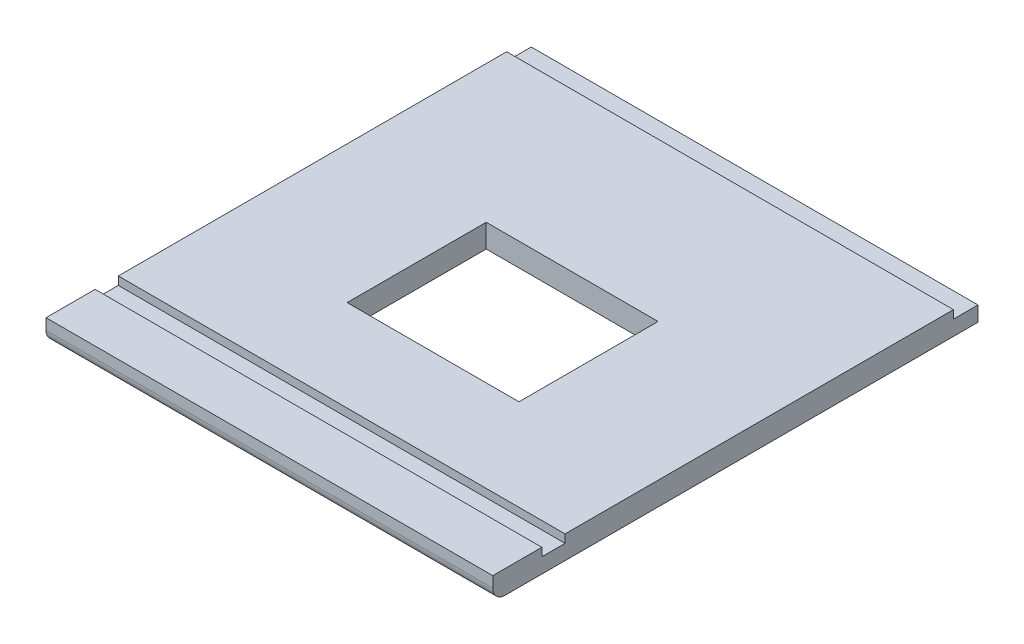
ISO-10303-21;
HEADER;
FILE_DESCRIPTION(('STEP AP214'),'2;1');
FILE_NAME('part.step','',(''),(''),'','','');
FILE_SCHEMA(('AUTOMOTIVE_DESIGN { 1 0 10303 214 1 1 1 1 }'));
ENDSEC;
DATA;
#1=APPLICATION_CONTEXT('core data for automotive mechanical design processes');
#2=APPLICATION_PROTOCOL_DEFINITION('international standard','automotive_design',2000,#1);
#3=PRODUCT_CONTEXT('',#1,'mechanical');
#4=PRODUCT('Part','Part','',(#3));
#5=PRODUCT_RELATED_PRODUCT_CATEGORY('part','',(#4));
#6=PRODUCT_DEFINITION_FORMATION('','',#4);
#7=PRODUCT_DEFINITION_CONTEXT('part definition',#1,'design');
#8=PRODUCT_DEFINITION('design','',#6,#7);
#9=PRODUCT_DEFINITION_SHAPE('','',#8);
#10=(LENGTH_UNIT() NAMED_UNIT(*) SI_UNIT(.MILLI.,.METRE.));
#11=(NAMED_UNIT(*) PLANE_ANGLE_UNIT() SI_UNIT($,.RADIAN.));
#12=(NAMED_UNIT(*) SI_UNIT($,.STERADIAN.) SOLID_ANGLE_UNIT());
#13=UNCERTAINTY_MEASURE_WITH_UNIT(LENGTH_MEASURE(1.E-05),#10,'distance_accuracy_value','');
#14=(GEOMETRIC_REPRESENTATION_CONTEXT(3) GLOBAL_UNCERTAINTY_ASSIGNED_CONTEXT((#13)) GLOBAL_UNIT_ASSIGNED_CONTEXT((#10,
#11,#12)) REPRESENTATION_CONTEXT('',''));
#15=CARTESIAN_POINT('',(0.,0.,0.));
#16=DIRECTION('',(0.,0.,1.));
#17=DIRECTION('',(1.,0.,0.));
#18=AXIS2_PLACEMENT_3D('',#15,#16,#17);
#19=CARTESIAN_POINT('',(0.,18.,0.));
#20=DIRECTION('',(0.,0.,1.));
#21=DIRECTION('',(1.,0.,0.));
#22=AXIS2_PLACEMENT_3D('',#19,#20,#21);
#23=PLANE('',#22);
#24=DIRECTION('',(1.,0.,0.));
#25=VECTOR('',#24,1.);
#26=CARTESIAN_POINT('',(0.,11.65,0.));
#27=LINE('',#26,#25);
#28=CARTESIAN_POINT('',(0.,11.65,0.));
#29=VERTEX_POINT('',#28);
#30=CARTESIAN_POINT('',(346.7,11.65,0.));
#31=VERTEX_POINT('',#30);
#32=EDGE_CURVE('E271',#29,#31,#27,.T.);
#33=ORIENTED_EDGE('',*,*,#32,.T.);
#34=DIRECTION('',(0.,-1.,0.));
#35=VECTOR('',#34,1.);
#36=CARTESIAN_POINT('',(346.7,18.,0.));
#37=LINE('',#36,#35);
#38=CARTESIAN_POINT('',(346.7,0.,0.));
#39=VERTEX_POINT('',#38);
#40=EDGE_CURVE('E179',#31,#39,#37,.T.);
#41=ORIENTED_EDGE('',*,*,#40,.T.);
#42=DIRECTION('',(-1.,0.,0.));
#43=VECTOR('',#42,1.);
#44=CARTESIAN_POINT('',(0.,0.,0.));
#45=LINE('',#44,#43);
#46=CARTESIAN_POINT('',(0.,0.,0.));
#47=VERTEX_POINT('',#46);
#48=EDGE_CURVE('E174',#39,#47,#45,.T.);
#49=ORIENTED_EDGE('',*,*,#48,.T.);
#50=DIRECTION('',(0.,-1.,0.));
#51=VECTOR('',#50,1.);
#52=CARTESIAN_POINT('',(0.,18.,0.));
#53=LINE('',#52,#51);
#54=EDGE_CURVE('E163',#29,#47,#53,.T.);
#55=ORIENTED_EDGE('',*,*,#54,.F.);
#56=EDGE_LOOP('',(#33,#41,#49,#55));
#57=FACE_BOUND('',#56,.T.);
#58=ADVANCED_FACE('F32',(#57),#23,.F.);
#59=CARTESIAN_POINT('',(0.,18.,0.));
#60=DIRECTION('',(0.,1.,0.));
#61=DIRECTION('',(0.,0.,1.));
#62=AXIS2_PLACEMENT_3D('',#59,#60,#61);
#63=PLANE('',#62);
#64=DIRECTION('',(1.,0.,0.));
#65=VECTOR('',#64,1.);
#66=CARTESIAN_POINT('',(346.7,18.,338.45000001));
#67=LINE('',#66,#65);
#68=CARTESIAN_POINT('',(0.,18.,338.45000001));
#69=VERTEX_POINT('',#68);
#70=CARTESIAN_POINT('',(346.7,18.,338.45000001));
#71=VERTEX_POINT('',#70);
#72=EDGE_CURVE('E208',#69,#71,#67,.T.);
#73=ORIENTED_EDGE('',*,*,#72,.F.);
#74=DIRECTION('',(0.,0.,1.));
#75=VECTOR('',#74,1.);
#76=CARTESIAN_POINT('',(0.,18.,0.));
#77=LINE('',#76,#75);
#78=CARTESIAN_POINT('',(0.,18.,376.55000001));
#79=VERTEX_POINT('',#78);
#80=EDGE_CURVE('E177',#69,#79,#77,.T.);
#81=ORIENTED_EDGE('',*,*,#80,.T.);
#82=DIRECTION('',(1.,0.,0.));
#83=VECTOR('',#82,1.);
#84=CARTESIAN_POINT('',(0.,18.,376.55000001));
#85=LINE('',#84,#83);
#86=CARTESIAN_POINT('',(346.7,18.,376.55000001));
#87=VERTEX_POINT('',#86);
#88=EDGE_CURVE('E160',#79,#87,#85,.T.);
#89=ORIENTED_EDGE('',*,*,#88,.T.);
#90=DIRECTION('',(0.,0.,-1.));
#91=VECTOR('',#90,1.);
#92=CARTESIAN_POINT('',(346.7,18.,0.));
#93=LINE('',#92,#91);
#94=EDGE_CURVE('E159',#87,#71,#93,.T.);
#95=ORIENTED_EDGE('',*,*,#94,.T.);
#96=EDGE_LOOP('',(#73,#81,#89,#95));
#97=FACE_BOUND('',#96,.T.);
#98=ADVANCED_FACE('F207',(#97),#63,.T.);
#99=CARTESIAN_POINT('',(0.,18.,0.));
#100=DIRECTION('',(1.,0.,0.));
#101=DIRECTION('',(0.,0.,-1.));
#102=AXIS2_PLACEMENT_3D('',#99,#100,#101);
#103=PLANE('',#102);
#104=CARTESIAN_POINT('',(0.,18.,19.05));
#105=VERTEX_POINT('',#104);
#106=CARTESIAN_POINT('',(0.,18.,320.45000001));
#107=VERTEX_POINT('',#106);
#108=EDGE_CURVE('E164',#105,#107,#77,.T.);
#109=ORIENTED_EDGE('',*,*,#108,.F.);
#110=DIRECTION('',(0.,1.,0.));
#111=VECTOR('',#110,1.);
#112=CARTESIAN_POINT('',(0.,-335.572972310301,19.05));
#113=LINE('',#112,#111);
#114=CARTESIAN_POINT('',(0.,11.65,19.05));
#115=VERTEX_POINT('',#114);
#116=EDGE_CURVE('E47',#115,#105,#113,.T.);
#117=ORIENTED_EDGE('',*,*,#116,.F.);
#118=DIRECTION('',(0.,0.,-1.));
#119=VECTOR('',#118,1.);
#120=CARTESIAN_POINT('',(0.,11.65,0.));
#121=LINE('',#120,#119);
#122=EDGE_CURVE('E267',#115,#29,#121,.T.);
#123=ORIENTED_EDGE('',*,*,#122,.T.);
#124=ORIENTED_EDGE('',*,*,#54,.T.);
#125=DIRECTION('',(0.,0.,1.));
#126=VECTOR('',#125,1.);
#127=CARTESIAN_POINT('',(0.,0.,0.));
#128=LINE('',#127,#126);
#129=CARTESIAN_POINT('',(0.,0.,367.02500001));
#130=VERTEX_POINT('',#129);
#131=EDGE_CURVE('E168',#47,#130,#128,.T.);
#132=ORIENTED_EDGE('',*,*,#131,.T.);
#133=CARTESIAN_POINT('',(0.,9.525,367.02500001));
#134=DIRECTION('',(1.,0.,0.));
#135=DIRECTION('',(0.,0.,-1.));
#136=AXIS2_PLACEMENT_3D('',#133,#134,#135);
#137=CIRCLE('',#136,9.525);
#138=CARTESIAN_POINT('',(0.,9.525,376.55000001));
#139=VERTEX_POINT('',#138);
#140=EDGE_CURVE('E11',#130,#139,#137,.F.);
#141=ORIENTED_EDGE('',*,*,#140,.T.);
#142=DIRECTION('',(0.,-1.,0.));
#143=VECTOR('',#142,1.);
#144=CARTESIAN_POINT('',(0.,18.,376.55000001));
#145=LINE('',#144,#143);
#146=EDGE_CURVE('E184',#79,#139,#145,.T.);
#147=ORIENTED_EDGE('',*,*,#146,.F.);
#148=ORIENTED_EDGE('',*,*,#80,.F.);
#149=DIRECTION('',(0.,1.,0.));
#150=VECTOR('',#149,1.);
#151=CARTESIAN_POINT('',(0.,11.65,338.45000001));
#152=LINE('',#151,#150);
#153=CARTESIAN_POINT('',(0.,11.65,338.45000001));
#154=VERTEX_POINT('',#153);
#155=EDGE_CURVE('E217',#154,#69,#152,.T.);
#156=ORIENTED_EDGE('',*,*,#155,.F.);
#157=DIRECTION('',(0.,0.,1.));
#158=VECTOR('',#157,1.);
#159=CARTESIAN_POINT('',(0.,11.65,338.45000001));
#160=LINE('',#159,#158);
#161=CARTESIAN_POINT('',(0.,11.65,320.45000001));
#162=VERTEX_POINT('',#161);
#163=EDGE_CURVE('E227',#162,#154,#160,.T.);
#164=ORIENTED_EDGE('',*,*,#163,.F.);
#165=DIRECTION('',(0.,1.,0.));
#166=VECTOR('',#165,1.);
#167=CARTESIAN_POINT('',(0.,11.65,320.45000001));
#168=LINE('',#167,#166);
#169=EDGE_CURVE('E213',#162,#107,#168,.T.);
#170=ORIENTED_EDGE('',*,*,#169,.T.);
#171=EDGE_LOOP('',(#109,#117,#123,#124,#132,#141,#147,#148,#156,#164,#170));
#172=FACE_BOUND('',#171,.T.);
#173=ADVANCED_FACE('F200',(#172),#103,.F.);
#174=CARTESIAN_POINT('',(0.,18.,376.55000001));
#175=DIRECTION('',(0.,0.,-1.));
#176=DIRECTION('',(-1.,0.,0.));
#177=AXIS2_PLACEMENT_3D('',#174,#175,#176);
#178=PLANE('',#177);
#179=ORIENTED_EDGE('',*,*,#146,.T.);
#180=DIRECTION('',(1.,0.,0.));
#181=VECTOR('',#180,1.);
#182=CARTESIAN_POINT('',(0.,9.525,376.55000001));
#183=LINE('',#182,#181);
#184=CARTESIAN_POINT('',(346.7,9.525,376.55000001));
#185=VERTEX_POINT('',#184);
#186=EDGE_CURVE('E187',#139,#185,#183,.T.);
#187=ORIENTED_EDGE('',*,*,#186,.T.);
#188=DIRECTION('',(0.,-1.,0.));
#189=VECTOR('',#188,1.);
#190=CARTESIAN_POINT('',(346.7,18.,376.55000001));
#191=LINE('',#190,#189);
#192=EDGE_CURVE('E181',#87,#185,#191,.T.);
#193=ORIENTED_EDGE('',*,*,#192,.F.);
#194=ORIENTED_EDGE('',*,*,#88,.F.);
#195=EDGE_LOOP('',(#179,#187,#193,#194));
#196=FACE_BOUND('',#195,.T.);
#197=ADVANCED_FACE('F204',(#196),#178,.F.);
#198=CARTESIAN_POINT('',(346.7,18.,0.));
#199=DIRECTION('',(-1.,0.,0.));
#200=DIRECTION('',(0.,0.,1.));
#201=AXIS2_PLACEMENT_3D('',#198,#199,#200);
#202=PLANE('',#201);
#203=DIRECTION('',(0.,0.,1.));
#204=VECTOR('',#203,1.);
#205=CARTESIAN_POINT('',(346.7,11.65,0.));
#206=LINE('',#205,#204);
#207=CARTESIAN_POINT('',(346.7,11.65,19.05));
#208=VERTEX_POINT('',#207);
#209=EDGE_CURVE('E152',#31,#208,#206,.T.);
#210=ORIENTED_EDGE('',*,*,#209,.T.);
#211=DIRECTION('',(0.,1.,0.));
#212=VECTOR('',#211,1.);
#213=CARTESIAN_POINT('',(346.7,-335.572972310301,19.05));
#214=LINE('',#213,#212);
#215=CARTESIAN_POINT('',(346.7,18.,19.05));
#216=VERTEX_POINT('',#215);
#217=EDGE_CURVE('E139',#208,#216,#214,.T.);
#218=ORIENTED_EDGE('',*,*,#217,.T.);
#219=CARTESIAN_POINT('',(346.7,18.,320.45000001));
#220=VERTEX_POINT('',#219);
#221=EDGE_CURVE('E150',#220,#216,#93,.T.);
#222=ORIENTED_EDGE('',*,*,#221,.F.);
#223=DIRECTION('',(0.,1.,0.));
#224=VECTOR('',#223,1.);
#225=CARTESIAN_POINT('',(346.7,11.65,320.45000001));
#226=LINE('',#225,#224);
#227=CARTESIAN_POINT('',(346.7,11.65,320.45000001));
#228=VERTEX_POINT('',#227);
#229=EDGE_CURVE('E211',#228,#220,#226,.T.);
#230=ORIENTED_EDGE('',*,*,#229,.F.);
#231=DIRECTION('',(0.,0.,-1.));
#232=VECTOR('',#231,1.);
#233=CARTESIAN_POINT('',(346.7,11.65,338.45000001));
#234=LINE('',#233,#232);
#235=CARTESIAN_POINT('',(346.7,11.65,338.45000001));
#236=VERTEX_POINT('',#235);
#237=EDGE_CURVE('E222',#236,#228,#234,.T.);
#238=ORIENTED_EDGE('',*,*,#237,.F.);
#239=DIRECTION('',(0.,1.,0.));
#240=VECTOR('',#239,1.);
#241=CARTESIAN_POINT('',(346.7,11.65,338.45000001));
#242=LINE('',#241,#240);
#243=EDGE_CURVE('E171',#236,#71,#242,.T.);
#244=ORIENTED_EDGE('',*,*,#243,.T.);
#245=ORIENTED_EDGE('',*,*,#94,.F.);
#246=ORIENTED_EDGE('',*,*,#192,.T.);
#247=CARTESIAN_POINT('',(346.7,9.525,367.02500001));
#248=DIRECTION('',(-1.,0.,0.));
#249=DIRECTION('',(0.,0.,1.));
#250=AXIS2_PLACEMENT_3D('',#247,#248,#249);
#251=CIRCLE('',#250,9.525);
#252=CARTESIAN_POINT('',(346.7,0.,367.02500001));
#253=VERTEX_POINT('',#252);
#254=EDGE_CURVE('E190',#185,#253,#251,.F.);
#255=ORIENTED_EDGE('',*,*,#254,.T.);
#256=DIRECTION('',(0.,0.,-1.));
#257=VECTOR('',#256,1.);
#258=CARTESIAN_POINT('',(346.7,0.,0.));
#259=LINE('',#258,#257);
#260=EDGE_CURVE('E170',#253,#39,#259,.T.);
#261=ORIENTED_EDGE('',*,*,#260,.T.);
#262=ORIENTED_EDGE('',*,*,#40,.F.);
#263=EDGE_LOOP('',(#210,#218,#222,#230,#238,#244,#245,#246,#255,#261,#262));
#264=FACE_BOUND('',#263,.T.);
#265=ADVANCED_FACE('F148',(#264),#202,.F.);
#266=DIRECTION('',(1.,0.,0.));
#267=VECTOR('',#266,1.);
#268=CARTESIAN_POINT('',(0.,18.,19.05));
#269=LINE('',#268,#267);
#270=EDGE_CURVE('E136',#105,#216,#269,.T.);
#271=ORIENTED_EDGE('',*,*,#270,.F.);
#272=ORIENTED_EDGE('',*,*,#108,.T.);
#273=DIRECTION('',(-1.,0.,0.));
#274=VECTOR('',#273,1.);
#275=CARTESIAN_POINT('',(346.7,18.,320.45000001));
#276=LINE('',#275,#274);
#277=EDGE_CURVE('E158',#220,#107,#276,.T.);
#278=ORIENTED_EDGE('',*,*,#277,.F.);
#279=ORIENTED_EDGE('',*,*,#221,.T.);
#280=EDGE_LOOP('',(#271,#272,#278,#279));
#281=FACE_BOUND('',#280,.T.);
#282=DIRECTION('',(0.,0.,1.));
#283=VECTOR('',#282,1.);
#284=CARTESIAN_POINT('',(106.675,18.,249.55000001));
#285=LINE('',#284,#283);
#286=CARTESIAN_POINT('',(106.675,18.,141.60000001));
#287=VERTEX_POINT('',#286);
#288=CARTESIAN_POINT('',(106.675,18.,249.55000001));
#289=VERTEX_POINT('',#288);
#290=EDGE_CURVE('E253',#287,#289,#285,.T.);
#291=ORIENTED_EDGE('',*,*,#290,.F.);
#292=DIRECTION('',(-1.,0.,0.));
#293=VECTOR('',#292,1.);
#294=CARTESIAN_POINT('',(106.675,18.,141.60000001));
#295=LINE('',#294,#293);
#296=CARTESIAN_POINT('',(240.025,18.,141.60000001));
#297=VERTEX_POINT('',#296);
#298=EDGE_CURVE('E243',#297,#287,#295,.T.);
#299=ORIENTED_EDGE('',*,*,#298,.F.);
#300=DIRECTION('',(0.,0.,-1.));
#301=VECTOR('',#300,1.);
#302=CARTESIAN_POINT('',(240.025,18.,249.55000001));
#303=LINE('',#302,#301);
#304=CARTESIAN_POINT('',(240.025,18.,249.55000001));
#305=VERTEX_POINT('',#304);
#306=EDGE_CURVE('E247',#305,#297,#303,.T.);
#307=ORIENTED_EDGE('',*,*,#306,.F.);
#308=DIRECTION('',(1.,0.,0.));
#309=VECTOR('',#308,1.);
#310=CARTESIAN_POINT('',(106.675,18.,249.55000001));
#311=LINE('',#310,#309);
#312=EDGE_CURVE('E250',#289,#305,#311,.T.);
#313=ORIENTED_EDGE('',*,*,#312,.F.);
#314=EDGE_LOOP('',(#291,#299,#307,#313));
#315=FACE_BOUND('',#314,.T.);
#316=ADVANCED_FACE('F155',(#281,#315),#63,.T.);
#317=CARTESIAN_POINT('',(0.,0.,0.));
#318=DIRECTION('',(0.,1.,0.));
#319=DIRECTION('',(0.,0.,1.));
#320=AXIS2_PLACEMENT_3D('',#317,#318,#319);
#321=PLANE('',#320);
#322=DIRECTION('',(-1.,0.,0.));
#323=VECTOR('',#322,1.);
#324=CARTESIAN_POINT('',(106.675,0.,141.60000001));
#325=LINE('',#324,#323);
#326=CARTESIAN_POINT('',(240.025,0.,141.60000001));
#327=VERTEX_POINT('',#326);
#328=CARTESIAN_POINT('',(106.675,0.,141.60000001));
#329=VERTEX_POINT('',#328);
#330=EDGE_CURVE('E238',#327,#329,#325,.T.);
#331=ORIENTED_EDGE('',*,*,#330,.T.);
#332=DIRECTION('',(0.,0.,1.));
#333=VECTOR('',#332,1.);
#334=CARTESIAN_POINT('',(106.675,0.,249.55000001));
#335=LINE('',#334,#333);
#336=CARTESIAN_POINT('',(106.675,0.,249.55000001));
#337=VERTEX_POINT('',#336);
#338=EDGE_CURVE('E246',#329,#337,#335,.T.);
#339=ORIENTED_EDGE('',*,*,#338,.T.);
#340=DIRECTION('',(1.,0.,0.));
#341=VECTOR('',#340,1.);
#342=CARTESIAN_POINT('',(106.675,0.,249.55000001));
#343=LINE('',#342,#341);
#344=CARTESIAN_POINT('',(240.025,0.,249.55000001));
#345=VERTEX_POINT('',#344);
#346=EDGE_CURVE('E261',#337,#345,#343,.T.);
#347=ORIENTED_EDGE('',*,*,#346,.T.);
#348=DIRECTION('',(0.,0.,-1.));
#349=VECTOR('',#348,1.);
#350=CARTESIAN_POINT('',(240.025,0.,249.55000001));
#351=LINE('',#350,#349);
#352=EDGE_CURVE('E258',#345,#327,#351,.T.);
#353=ORIENTED_EDGE('',*,*,#352,.T.);
#354=EDGE_LOOP('',(#331,#339,#347,#353));
#355=FACE_BOUND('',#354,.T.);
#356=ORIENTED_EDGE('',*,*,#260,.F.);
#357=DIRECTION('',(1.,0.,0.));
#358=VECTOR('',#357,1.);
#359=CARTESIAN_POINT('',(0.,0.,367.02500001));
#360=LINE('',#359,#358);
#361=EDGE_CURVE('E40',#253,#130,#360,.F.);
#362=ORIENTED_EDGE('',*,*,#361,.T.);
#363=ORIENTED_EDGE('',*,*,#131,.F.);
#364=ORIENTED_EDGE('',*,*,#48,.F.);
#365=EDGE_LOOP('',(#356,#362,#363,#364));
#366=FACE_BOUND('',#365,.T.);
#367=ADVANCED_FACE('F196',(#355,#366),#321,.F.);
#368=CARTESIAN_POINT('',(346.7,11.65,338.45000001));
#369=DIRECTION('',(0.,0.,1.));
#370=DIRECTION('',(1.,0.,0.));
#371=AXIS2_PLACEMENT_3D('',#368,#369,#370);
#372=PLANE('',#371);
#373=ORIENTED_EDGE('',*,*,#72,.T.);
#374=ORIENTED_EDGE('',*,*,#243,.F.);
#375=DIRECTION('',(1.,0.,0.));
#376=VECTOR('',#375,1.);
#377=CARTESIAN_POINT('',(346.7,11.65,338.45000001));
#378=LINE('',#377,#376);
#379=EDGE_CURVE('E214',#154,#236,#378,.T.);
#380=ORIENTED_EDGE('',*,*,#379,.F.);
#381=ORIENTED_EDGE('',*,*,#155,.T.);
#382=EDGE_LOOP('',(#373,#374,#380,#381));
#383=FACE_BOUND('',#382,.T.);
#384=ADVANCED_FACE('F287',(#383),#372,.F.);
#385=CARTESIAN_POINT('',(346.7,11.65,320.45000001));
#386=DIRECTION('',(0.,0.,-1.));
#387=DIRECTION('',(-1.,0.,0.));
#388=AXIS2_PLACEMENT_3D('',#385,#386,#387);
#389=PLANE('',#388);
#390=ORIENTED_EDGE('',*,*,#277,.T.);
#391=ORIENTED_EDGE('',*,*,#169,.F.);
#392=DIRECTION('',(-1.,0.,0.));
#393=VECTOR('',#392,1.);
#394=CARTESIAN_POINT('',(346.7,11.65,320.45000001));
#395=LINE('',#394,#393);
#396=EDGE_CURVE('E229',#228,#162,#395,.T.);
#397=ORIENTED_EDGE('',*,*,#396,.F.);
#398=ORIENTED_EDGE('',*,*,#229,.T.);
#399=EDGE_LOOP('',(#390,#391,#397,#398));
#400=FACE_BOUND('',#399,.T.);
#401=ADVANCED_FACE('F281',(#400),#389,.F.);
#402=CARTESIAN_POINT('',(0.,11.65,0.));
#403=DIRECTION('',(0.,1.,0.));
#404=DIRECTION('',(0.,0.,1.));
#405=AXIS2_PLACEMENT_3D('',#402,#403,#404);
#406=PLANE('',#405);
#407=ORIENTED_EDGE('',*,*,#237,.T.);
#408=ORIENTED_EDGE('',*,*,#396,.T.);
#409=ORIENTED_EDGE('',*,*,#163,.T.);
#410=ORIENTED_EDGE('',*,*,#379,.T.);
#411=EDGE_LOOP('',(#407,#408,#409,#410));
#412=FACE_BOUND('',#411,.T.);
#413=ADVANCED_FACE('F284',(#412),#406,.T.);
#414=CARTESIAN_POINT('',(106.675,0.,249.55000001));
#415=DIRECTION('',(-1.,0.,0.));
#416=DIRECTION('',(0.,0.,1.));
#417=AXIS2_PLACEMENT_3D('',#414,#415,#416);
#418=PLANE('',#417);
#419=ORIENTED_EDGE('',*,*,#290,.T.);
#420=DIRECTION('',(0.,1.,0.));
#421=VECTOR('',#420,1.);
#422=CARTESIAN_POINT('',(106.675,0.,249.55000001));
#423=LINE('',#422,#421);
#424=EDGE_CURVE('E234',#337,#289,#423,.T.);
#425=ORIENTED_EDGE('',*,*,#424,.F.);
#426=ORIENTED_EDGE('',*,*,#338,.F.);
#427=DIRECTION('',(0.,1.,0.));
#428=VECTOR('',#427,1.);
#429=CARTESIAN_POINT('',(106.675,0.,141.60000001));
#430=LINE('',#429,#428);
#431=EDGE_CURVE('E224',#329,#287,#430,.T.);
#432=ORIENTED_EDGE('',*,*,#431,.T.);
#433=EDGE_LOOP('',(#419,#425,#426,#432));
#434=FACE_BOUND('',#433,.T.);
#435=ADVANCED_FACE('F371',(#434),#418,.F.);
#436=CARTESIAN_POINT('',(106.675,0.,141.60000001));
#437=DIRECTION('',(0.,0.,-1.));
#438=DIRECTION('',(-1.,0.,0.));
#439=AXIS2_PLACEMENT_3D('',#436,#437,#438);
#440=PLANE('',#439);
#441=ORIENTED_EDGE('',*,*,#298,.T.);
#442=ORIENTED_EDGE('',*,*,#431,.F.);
#443=ORIENTED_EDGE('',*,*,#330,.F.);
#444=DIRECTION('',(0.,1.,0.));
#445=VECTOR('',#444,1.);
#446=CARTESIAN_POINT('',(240.025,0.,141.60000001));
#447=LINE('',#446,#445);
#448=EDGE_CURVE('E240',#327,#297,#447,.T.);
#449=ORIENTED_EDGE('',*,*,#448,.T.);
#450=EDGE_LOOP('',(#441,#442,#443,#449));
#451=FACE_BOUND('',#450,.T.);
#452=ADVANCED_FACE('F367',(#451),#440,.F.);
#453=CARTESIAN_POINT('',(240.025,0.,249.55000001));
#454=DIRECTION('',(1.,0.,0.));
#455=DIRECTION('',(0.,0.,-1.));
#456=AXIS2_PLACEMENT_3D('',#453,#454,#455);
#457=PLANE('',#456);
#458=ORIENTED_EDGE('',*,*,#306,.T.);
#459=ORIENTED_EDGE('',*,*,#448,.F.);
#460=ORIENTED_EDGE('',*,*,#352,.F.);
#461=DIRECTION('',(0.,1.,0.));
#462=VECTOR('',#461,1.);
#463=CARTESIAN_POINT('',(240.025,0.,249.55000001));
#464=LINE('',#463,#462);
#465=EDGE_CURVE('E237',#345,#305,#464,.T.);
#466=ORIENTED_EDGE('',*,*,#465,.T.);
#467=EDGE_LOOP('',(#458,#459,#460,#466));
#468=FACE_BOUND('',#467,.T.);
#469=ADVANCED_FACE('F370',(#468),#457,.F.);
#470=CARTESIAN_POINT('',(106.675,0.,249.55000001));
#471=DIRECTION('',(0.,0.,1.));
#472=DIRECTION('',(1.,0.,0.));
#473=AXIS2_PLACEMENT_3D('',#470,#471,#472);
#474=PLANE('',#473);
#475=ORIENTED_EDGE('',*,*,#312,.T.);
#476=ORIENTED_EDGE('',*,*,#465,.F.);
#477=ORIENTED_EDGE('',*,*,#346,.F.);
#478=ORIENTED_EDGE('',*,*,#424,.T.);
#479=EDGE_LOOP('',(#475,#476,#477,#478));
#480=FACE_BOUND('',#479,.T.);
#481=ADVANCED_FACE('F341',(#480),#474,.F.);
#482=CARTESIAN_POINT('',(0.,9.525,367.02500001));
#483=DIRECTION('',(1.,0.,0.));
#484=DIRECTION('',(0.,0.,-1.));
#485=AXIS2_PLACEMENT_3D('',#482,#483,#484);
#486=CYLINDRICAL_SURFACE('',#485,9.525);
#487=ORIENTED_EDGE('',*,*,#140,.F.);
#488=ORIENTED_EDGE('',*,*,#361,.F.);
#489=ORIENTED_EDGE('',*,*,#254,.F.);
#490=ORIENTED_EDGE('',*,*,#186,.F.);
#491=EDGE_LOOP('',(#487,#488,#489,#490));
#492=FACE_BOUND('',#491,.T.);
#493=ADVANCED_FACE('F34',(#492),#486,.T.);
#494=CARTESIAN_POINT('',(0.,-335.572972310301,19.05));
#495=DIRECTION('',(0.,0.,1.));
#496=DIRECTION('',(1.,0.,0.));
#497=AXIS2_PLACEMENT_3D('',#494,#495,#496);
#498=PLANE('',#497);
#499=DIRECTION('',(-1.,0.,0.));
#500=VECTOR('',#499,1.);
#501=CARTESIAN_POINT('',(0.,11.65,19.05));
#502=LINE('',#501,#500);
#503=EDGE_CURVE('E255',#208,#115,#502,.T.);
#504=ORIENTED_EDGE('',*,*,#503,.T.);
#505=ORIENTED_EDGE('',*,*,#116,.T.);
#506=ORIENTED_EDGE('',*,*,#270,.T.);
#507=ORIENTED_EDGE('',*,*,#217,.F.);
#508=EDGE_LOOP('',(#504,#505,#506,#507));
#509=FACE_BOUND('',#508,.T.);
#510=ADVANCED_FACE('F138',(#509),#498,.F.);
#511=CARTESIAN_POINT('',(0.,11.65,0.));
#512=DIRECTION('',(0.,1.,0.));
#513=DIRECTION('',(0.,0.,1.));
#514=AXIS2_PLACEMENT_3D('',#511,#512,#513);
#515=PLANE('',#514);
#516=ORIENTED_EDGE('',*,*,#122,.F.);
#517=ORIENTED_EDGE('',*,*,#503,.F.);
#518=ORIENTED_EDGE('',*,*,#209,.F.);
#519=ORIENTED_EDGE('',*,*,#32,.F.);
#520=EDGE_LOOP('',(#516,#517,#518,#519));
#521=FACE_BOUND('',#520,.T.);
#522=ADVANCED_FACE('F278',(#521),#515,.T.);
#523=CLOSED_SHELL('',(#58,#98,#173,#197,#265,#316,#367,#384,#401,#413,#435,#452,#469,#481,#493,
#510,#522));
#524=MANIFOLD_SOLID_BREP('B2',#523);
#525=ADVANCED_BREP_SHAPE_REPRESENTATION('',(#18,#524),#14);
#526=SHAPE_DEFINITION_REPRESENTATION(#9,#525);
ENDSEC;
END-ISO-10303-21;
